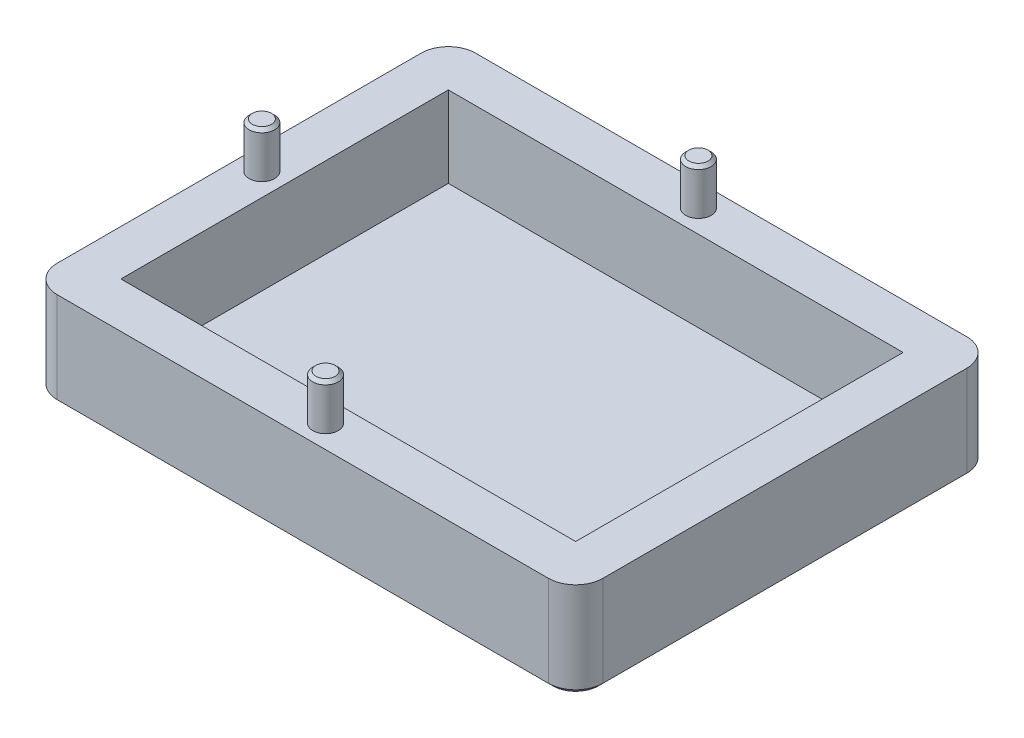
ISO-10303-21;
HEADER;
FILE_DESCRIPTION(('STEP AP214'),'2;1');
FILE_NAME('part.step','',(''),(''),'','','');
FILE_SCHEMA(('AUTOMOTIVE_DESIGN { 1 0 10303 214 1 1 1 1 }'));
ENDSEC;
DATA;
#1=APPLICATION_CONTEXT('core data for automotive mechanical design processes');
#2=APPLICATION_PROTOCOL_DEFINITION('international standard','automotive_design',2000,#1);
#3=PRODUCT_CONTEXT('',#1,'mechanical');
#4=PRODUCT('Part','Part','',(#3));
#5=PRODUCT_RELATED_PRODUCT_CATEGORY('part','',(#4));
#6=PRODUCT_DEFINITION_FORMATION('','',#4);
#7=PRODUCT_DEFINITION_CONTEXT('part definition',#1,'design');
#8=PRODUCT_DEFINITION('design','',#6,#7);
#9=PRODUCT_DEFINITION_SHAPE('','',#8);
#10=(LENGTH_UNIT() NAMED_UNIT(*) SI_UNIT(.MILLI.,.METRE.));
#11=(NAMED_UNIT(*) PLANE_ANGLE_UNIT() SI_UNIT($,.RADIAN.));
#12=(NAMED_UNIT(*) SI_UNIT($,.STERADIAN.) SOLID_ANGLE_UNIT());
#13=UNCERTAINTY_MEASURE_WITH_UNIT(LENGTH_MEASURE(1.E-05),#10,'distance_accuracy_value','');
#14=(GEOMETRIC_REPRESENTATION_CONTEXT(3) GLOBAL_UNCERTAINTY_ASSIGNED_CONTEXT((#13)) GLOBAL_UNIT_ASSIGNED_CONTEXT((#10,
#11,#12)) REPRESENTATION_CONTEXT('',''));
#15=CARTESIAN_POINT('',(0.,0.,0.));
#16=DIRECTION('',(0.,0.,1.));
#17=DIRECTION('',(1.,0.,0.));
#18=AXIS2_PLACEMENT_3D('',#15,#16,#17);
#19=CARTESIAN_POINT('',(0.,10.5,0.));
#20=DIRECTION('',(0.,-1.,0.));
#21=DIRECTION('',(0.,0.,-1.));
#22=AXIS2_PLACEMENT_3D('',#19,#20,#21);
#23=PLANE('',#22);
#24=CARTESIAN_POINT('',(25.,10.5,2.5));
#25=DIRECTION('',(0.,-1.,0.));
#26=DIRECTION('',(0.,0.,-1.));
#27=AXIS2_PLACEMENT_3D('',#24,#25,#26);
#28=CIRCLE('',#27,1.4);
#29=CARTESIAN_POINT('',(25.,10.5,1.1));
#30=VERTEX_POINT('',#29);
#31=EDGE_CURVE('E242',#30,#30,#28,.F.);
#32=ORIENTED_EDGE('',*,*,#31,.F.);
#33=EDGE_LOOP('',(#32));
#34=FACE_BOUND('',#33,.T.);
#35=CARTESIAN_POINT('',(-2.5,10.5,-18.));
#36=DIRECTION('',(0.,-1.,0.));
#37=DIRECTION('',(0.,0.,-1.));
#38=AXIS2_PLACEMENT_3D('',#35,#36,#37);
#39=CIRCLE('',#38,1.4);
#40=CARTESIAN_POINT('',(-2.5,10.5,-19.4));
#41=VERTEX_POINT('',#40);
#42=EDGE_CURVE('E239',#41,#41,#39,.F.);
#43=ORIENTED_EDGE('',*,*,#42,.F.);
#44=EDGE_LOOP('',(#43));
#45=FACE_BOUND('',#44,.T.);
#46=CARTESIAN_POINT('',(25.,10.5,-38.5));
#47=DIRECTION('',(0.,-1.,0.));
#48=DIRECTION('',(0.,0.,-1.));
#49=AXIS2_PLACEMENT_3D('',#46,#47,#48);
#50=CIRCLE('',#49,1.4);
#51=CARTESIAN_POINT('',(25.,10.5,-39.9));
#52=VERTEX_POINT('',#51);
#53=EDGE_CURVE('E236',#52,#52,#50,.F.);
#54=ORIENTED_EDGE('',*,*,#53,.F.);
#55=EDGE_LOOP('',(#54));
#56=FACE_BOUND('',#55,.T.);
#57=DIRECTION('',(0.,0.,-1.));
#58=VECTOR('',#57,1.);
#59=CARTESIAN_POINT('',(55.,10.5,5.));
#60=LINE('',#59,#58);
#61=CARTESIAN_POINT('',(55.,10.5,2.));
#62=VERTEX_POINT('',#61);
#63=CARTESIAN_POINT('',(55.,10.5,-38.));
#64=VERTEX_POINT('',#63);
#65=EDGE_CURVE('E204',#62,#64,#60,.T.);
#66=ORIENTED_EDGE('',*,*,#65,.T.);
#67=CARTESIAN_POINT('',(52.,10.5,-38.));
#68=DIRECTION('',(0.,-1.,0.));
#69=DIRECTION('',(0.,0.,-1.));
#70=AXIS2_PLACEMENT_3D('',#67,#68,#69);
#71=CIRCLE('',#70,3.);
#72=CARTESIAN_POINT('',(52.,10.5,-41.));
#73=VERTEX_POINT('',#72);
#74=EDGE_CURVE('E224',#64,#73,#71,.F.);
#75=ORIENTED_EDGE('',*,*,#74,.T.);
#76=DIRECTION('',(-1.,0.,0.));
#77=VECTOR('',#76,1.);
#78=CARTESIAN_POINT('',(-5.,10.5,-41.));
#79=LINE('',#78,#77);
#80=CARTESIAN_POINT('',(-2.,10.5,-41.));
#81=VERTEX_POINT('',#80);
#82=EDGE_CURVE('E207',#73,#81,#79,.T.);
#83=ORIENTED_EDGE('',*,*,#82,.T.);
#84=CARTESIAN_POINT('',(-2.,10.5,-38.));
#85=DIRECTION('',(0.,-1.,0.));
#86=DIRECTION('',(0.,0.,-1.));
#87=AXIS2_PLACEMENT_3D('',#84,#85,#86);
#88=CIRCLE('',#87,3.);
#89=CARTESIAN_POINT('',(-5.,10.5,-38.));
#90=VERTEX_POINT('',#89);
#91=EDGE_CURVE('E222',#81,#90,#88,.F.);
#92=ORIENTED_EDGE('',*,*,#91,.T.);
#93=DIRECTION('',(0.,0.,1.));
#94=VECTOR('',#93,1.);
#95=CARTESIAN_POINT('',(-5.,10.5,5.));
#96=LINE('',#95,#94);
#97=CARTESIAN_POINT('',(-5.,10.5,2.));
#98=VERTEX_POINT('',#97);
#99=EDGE_CURVE('E198',#90,#98,#96,.T.);
#100=ORIENTED_EDGE('',*,*,#99,.T.);
#101=CARTESIAN_POINT('',(-2.,10.5,2.));
#102=DIRECTION('',(0.,-1.,0.));
#103=DIRECTION('',(0.,0.,-1.));
#104=AXIS2_PLACEMENT_3D('',#101,#102,#103);
#105=CIRCLE('',#104,3.);
#106=CARTESIAN_POINT('',(-2.,10.5,5.));
#107=VERTEX_POINT('',#106);
#108=EDGE_CURVE('E218',#98,#107,#105,.F.);
#109=ORIENTED_EDGE('',*,*,#108,.T.);
#110=DIRECTION('',(1.,0.,0.));
#111=VECTOR('',#110,1.);
#112=CARTESIAN_POINT('',(-5.,10.5,5.));
#113=LINE('',#112,#111);
#114=CARTESIAN_POINT('',(52.,10.5,5.));
#115=VERTEX_POINT('',#114);
#116=EDGE_CURVE('E201',#107,#115,#113,.T.);
#117=ORIENTED_EDGE('',*,*,#116,.T.);
#118=CARTESIAN_POINT('',(52.,10.5,2.));
#119=DIRECTION('',(0.,-1.,0.));
#120=DIRECTION('',(0.,0.,-1.));
#121=AXIS2_PLACEMENT_3D('',#118,#119,#120);
#122=CIRCLE('',#121,3.);
#123=EDGE_CURVE('E220',#115,#62,#122,.F.);
#124=ORIENTED_EDGE('',*,*,#123,.T.);
#125=EDGE_LOOP('',(#66,#75,#83,#92,#100,#109,#117,#124));
#126=FACE_BOUND('',#125,.T.);
#127=DIRECTION('',(0.,0.,1.));
#128=VECTOR('',#127,1.);
#129=CARTESIAN_POINT('',(0.,10.5,0.));
#130=LINE('',#129,#128);
#131=CARTESIAN_POINT('',(0.,10.5,-36.));
#132=VERTEX_POINT('',#131);
#133=CARTESIAN_POINT('',(0.,10.5,0.));
#134=VERTEX_POINT('',#133);
#135=EDGE_CURVE('E181',#132,#134,#130,.T.);
#136=ORIENTED_EDGE('',*,*,#135,.F.);
#137=DIRECTION('',(-1.,0.,0.));
#138=VECTOR('',#137,1.);
#139=CARTESIAN_POINT('',(0.,10.5,-36.));
#140=LINE('',#139,#138);
#141=CARTESIAN_POINT('',(50.,10.5,-36.));
#142=VERTEX_POINT('',#141);
#143=EDGE_CURVE('E163',#142,#132,#140,.T.);
#144=ORIENTED_EDGE('',*,*,#143,.F.);
#145=DIRECTION('',(0.,0.,-1.));
#146=VECTOR('',#145,1.);
#147=CARTESIAN_POINT('',(50.,10.5,0.));
#148=LINE('',#147,#146);
#149=CARTESIAN_POINT('',(50.,10.5,0.));
#150=VERTEX_POINT('',#149);
#151=EDGE_CURVE('E189',#150,#142,#148,.T.);
#152=ORIENTED_EDGE('',*,*,#151,.F.);
#153=DIRECTION('',(1.,0.,0.));
#154=VECTOR('',#153,1.);
#155=CARTESIAN_POINT('',(0.,10.5,0.));
#156=LINE('',#155,#154);
#157=EDGE_CURVE('E183',#134,#150,#156,.T.);
#158=ORIENTED_EDGE('',*,*,#157,.F.);
#159=EDGE_LOOP('',(#136,#144,#152,#158));
#160=FACE_BOUND('',#159,.T.);
#161=ADVANCED_FACE('F41',(#34,#45,#56,#126,#160),#23,.F.);
#162=CARTESIAN_POINT('',(0.,0.,0.));
#163=DIRECTION('',(0.,-1.,0.));
#164=DIRECTION('',(0.,0.,-1.));
#165=AXIS2_PLACEMENT_3D('',#162,#163,#164);
#166=PLANE('',#165);
#167=DIRECTION('',(0.,0.,-1.));
#168=VECTOR('',#167,1.);
#169=CARTESIAN_POINT('',(-4.49999999999999,0.,-38.));
#170=LINE('',#169,#168);
#171=CARTESIAN_POINT('',(-4.49999999999999,0.,2.));
#172=VERTEX_POINT('',#171);
#173=CARTESIAN_POINT('',(-4.49999999999999,0.,-38.));
#174=VERTEX_POINT('',#173);
#175=EDGE_CURVE('E275',#172,#174,#170,.T.);
#176=ORIENTED_EDGE('',*,*,#175,.T.);
#177=CARTESIAN_POINT('',(-2.,0.,-38.));
#178=DIRECTION('',(0.,-1.,0.));
#179=DIRECTION('',(0.,0.,-1.));
#180=AXIS2_PLACEMENT_3D('',#177,#178,#179);
#181=CIRCLE('',#180,2.5);
#182=CARTESIAN_POINT('',(-2.,0.,-40.5));
#183=VERTEX_POINT('',#182);
#184=EDGE_CURVE('E277',#174,#183,#181,.T.);
#185=ORIENTED_EDGE('',*,*,#184,.T.);
#186=DIRECTION('',(1.,0.,0.));
#187=VECTOR('',#186,1.);
#188=CARTESIAN_POINT('',(52.,0.,-40.5));
#189=LINE('',#188,#187);
#190=CARTESIAN_POINT('',(52.,0.,-40.5));
#191=VERTEX_POINT('',#190);
#192=EDGE_CURVE('E263',#183,#191,#189,.T.);
#193=ORIENTED_EDGE('',*,*,#192,.T.);
#194=CARTESIAN_POINT('',(52.,0.,-38.));
#195=DIRECTION('',(0.,-1.,0.));
#196=DIRECTION('',(0.,0.,-1.));
#197=AXIS2_PLACEMENT_3D('',#194,#195,#196);
#198=CIRCLE('',#197,2.5);
#199=CARTESIAN_POINT('',(54.5,0.,-38.));
#200=VERTEX_POINT('',#199);
#201=EDGE_CURVE('E265',#191,#200,#198,.T.);
#202=ORIENTED_EDGE('',*,*,#201,.T.);
#203=DIRECTION('',(0.,0.,1.));
#204=VECTOR('',#203,1.);
#205=CARTESIAN_POINT('',(54.5,0.,2.));
#206=LINE('',#205,#204);
#207=CARTESIAN_POINT('',(54.5,0.,2.));
#208=VERTEX_POINT('',#207);
#209=EDGE_CURVE('E267',#200,#208,#206,.T.);
#210=ORIENTED_EDGE('',*,*,#209,.T.);
#211=CARTESIAN_POINT('',(52.,0.,2.));
#212=DIRECTION('',(0.,-1.,0.));
#213=DIRECTION('',(0.,0.,-1.));
#214=AXIS2_PLACEMENT_3D('',#211,#212,#213);
#215=CIRCLE('',#214,2.49999999999999);
#216=CARTESIAN_POINT('',(52.,0.,4.5));
#217=VERTEX_POINT('',#216);
#218=EDGE_CURVE('E269',#208,#217,#215,.T.);
#219=ORIENTED_EDGE('',*,*,#218,.T.);
#220=DIRECTION('',(-1.,0.,0.));
#221=VECTOR('',#220,1.);
#222=CARTESIAN_POINT('',(-2.,0.,4.49999999999999));
#223=LINE('',#222,#221);
#224=CARTESIAN_POINT('',(-2.,0.,4.49999999999999));
#225=VERTEX_POINT('',#224);
#226=EDGE_CURVE('E271',#217,#225,#223,.T.);
#227=ORIENTED_EDGE('',*,*,#226,.T.);
#228=CARTESIAN_POINT('',(-2.,0.,2.));
#229=DIRECTION('',(0.,-1.,0.));
#230=DIRECTION('',(0.,0.,-1.));
#231=AXIS2_PLACEMENT_3D('',#228,#229,#230);
#232=CIRCLE('',#231,2.49999999999999);
#233=EDGE_CURVE('E273',#225,#172,#232,.T.);
#234=ORIENTED_EDGE('',*,*,#233,.T.);
#235=EDGE_LOOP('',(#176,#185,#193,#202,#210,#219,#227,#234));
#236=FACE_BOUND('',#235,.T.);
#237=ADVANCED_FACE('F377',(#236),#166,.T.);
#238=CARTESIAN_POINT('',(-5.,10.5,5.));
#239=DIRECTION('',(1.,0.,0.));
#240=DIRECTION('',(0.,0.,-1.));
#241=AXIS2_PLACEMENT_3D('',#238,#239,#240);
#242=PLANE('',#241);
#243=DIRECTION('',(0.,-1.,0.));
#244=VECTOR('',#243,1.);
#245=CARTESIAN_POINT('',(-5.,10.5,-38.));
#246=LINE('',#245,#244);
#247=CARTESIAN_POINT('',(-5.,0.500000000000007,-38.));
#248=VERTEX_POINT('',#247);
#249=EDGE_CURVE('E228',#90,#248,#246,.T.);
#250=ORIENTED_EDGE('',*,*,#249,.T.);
#251=DIRECTION('',(0.,0.,1.));
#252=VECTOR('',#251,1.);
#253=CARTESIAN_POINT('',(-5.,0.500000000000007,2.));
#254=LINE('',#253,#252);
#255=CARTESIAN_POINT('',(-5.,0.500000000000007,2.));
#256=VERTEX_POINT('',#255);
#257=EDGE_CURVE('E283',#248,#256,#254,.T.);
#258=ORIENTED_EDGE('',*,*,#257,.T.);
#259=DIRECTION('',(0.,-1.,0.));
#260=VECTOR('',#259,1.);
#261=CARTESIAN_POINT('',(-5.,10.5,2.));
#262=LINE('',#261,#260);
#263=EDGE_CURVE('E226',#256,#98,#262,.F.);
#264=ORIENTED_EDGE('',*,*,#263,.T.);
#265=ORIENTED_EDGE('',*,*,#99,.F.);
#266=EDGE_LOOP('',(#250,#258,#264,#265));
#267=FACE_BOUND('',#266,.T.);
#268=ADVANCED_FACE('F360',(#267),#242,.F.);
#269=CARTESIAN_POINT('',(-5.,10.5,5.));
#270=DIRECTION('',(0.,0.,-1.));
#271=DIRECTION('',(-1.,0.,0.));
#272=AXIS2_PLACEMENT_3D('',#269,#270,#271);
#273=PLANE('',#272);
#274=DIRECTION('',(0.,-1.,0.));
#275=VECTOR('',#274,1.);
#276=CARTESIAN_POINT('',(-2.,10.5,5.));
#277=LINE('',#276,#275);
#278=CARTESIAN_POINT('',(-2.,0.500000000000007,5.));
#279=VERTEX_POINT('',#278);
#280=EDGE_CURVE('E231',#107,#279,#277,.T.);
#281=ORIENTED_EDGE('',*,*,#280,.T.);
#282=DIRECTION('',(1.,0.,0.));
#283=VECTOR('',#282,1.);
#284=CARTESIAN_POINT('',(52.,0.500000000000007,5.));
#285=LINE('',#284,#283);
#286=CARTESIAN_POINT('',(52.,0.500000000000007,5.));
#287=VERTEX_POINT('',#286);
#288=EDGE_CURVE('E287',#279,#287,#285,.T.);
#289=ORIENTED_EDGE('',*,*,#288,.T.);
#290=DIRECTION('',(0.,-1.,0.));
#291=VECTOR('',#290,1.);
#292=CARTESIAN_POINT('',(52.,10.5,5.));
#293=LINE('',#292,#291);
#294=EDGE_CURVE('E234',#287,#115,#293,.F.);
#295=ORIENTED_EDGE('',*,*,#294,.T.);
#296=ORIENTED_EDGE('',*,*,#116,.F.);
#297=EDGE_LOOP('',(#281,#289,#295,#296));
#298=FACE_BOUND('',#297,.T.);
#299=ADVANCED_FACE('F369',(#298),#273,.F.);
#300=CARTESIAN_POINT('',(55.,10.5,5.));
#301=DIRECTION('',(-1.,0.,0.));
#302=DIRECTION('',(0.,0.,1.));
#303=AXIS2_PLACEMENT_3D('',#300,#301,#302);
#304=PLANE('',#303);
#305=DIRECTION('',(0.,-1.,0.));
#306=VECTOR('',#305,1.);
#307=CARTESIAN_POINT('',(55.,10.5,2.));
#308=LINE('',#307,#306);
#309=CARTESIAN_POINT('',(55.,0.500000000000007,2.));
#310=VERTEX_POINT('',#309);
#311=EDGE_CURVE('E214',#62,#310,#308,.T.);
#312=ORIENTED_EDGE('',*,*,#311,.T.);
#313=DIRECTION('',(0.,0.,-1.));
#314=VECTOR('',#313,1.);
#315=CARTESIAN_POINT('',(55.,0.500000000000007,-38.));
#316=LINE('',#315,#314);
#317=CARTESIAN_POINT('',(55.,0.500000000000007,-38.));
#318=VERTEX_POINT('',#317);
#319=EDGE_CURVE('E66',#310,#318,#316,.T.);
#320=ORIENTED_EDGE('',*,*,#319,.T.);
#321=DIRECTION('',(0.,-1.,0.));
#322=VECTOR('',#321,1.);
#323=CARTESIAN_POINT('',(55.,10.5,-38.));
#324=LINE('',#323,#322);
#325=EDGE_CURVE('E216',#318,#64,#324,.F.);
#326=ORIENTED_EDGE('',*,*,#325,.T.);
#327=ORIENTED_EDGE('',*,*,#65,.F.);
#328=EDGE_LOOP('',(#312,#320,#326,#327));
#329=FACE_BOUND('',#328,.T.);
#330=ADVANCED_FACE('F329',(#329),#304,.F.);
#331=CARTESIAN_POINT('',(-5.,10.5,-41.));
#332=DIRECTION('',(0.,0.,1.));
#333=DIRECTION('',(1.,0.,0.));
#334=AXIS2_PLACEMENT_3D('',#331,#332,#333);
#335=PLANE('',#334);
#336=DIRECTION('',(0.,-1.,0.));
#337=VECTOR('',#336,1.);
#338=CARTESIAN_POINT('',(52.,10.5,-41.));
#339=LINE('',#338,#337);
#340=CARTESIAN_POINT('',(52.,0.500000000000007,-41.));
#341=VERTEX_POINT('',#340);
#342=EDGE_CURVE('E212',#73,#341,#339,.T.);
#343=ORIENTED_EDGE('',*,*,#342,.T.);
#344=DIRECTION('',(-1.,0.,0.));
#345=VECTOR('',#344,1.);
#346=CARTESIAN_POINT('',(-2.,0.500000000000007,-41.));
#347=LINE('',#346,#345);
#348=CARTESIAN_POINT('',(-2.,0.500000000000007,-41.));
#349=VERTEX_POINT('',#348);
#350=EDGE_CURVE('E11',#341,#349,#347,.T.);
#351=ORIENTED_EDGE('',*,*,#350,.T.);
#352=DIRECTION('',(0.,-1.,0.));
#353=VECTOR('',#352,1.);
#354=CARTESIAN_POINT('',(-2.,10.5,-41.));
#355=LINE('',#354,#353);
#356=EDGE_CURVE('E210',#349,#81,#355,.F.);
#357=ORIENTED_EDGE('',*,*,#356,.T.);
#358=ORIENTED_EDGE('',*,*,#82,.F.);
#359=EDGE_LOOP('',(#343,#351,#357,#358));
#360=FACE_BOUND('',#359,.T.);
#361=ADVANCED_FACE('F338',(#360),#335,.F.);
#362=CARTESIAN_POINT('',(0.,10.5,0.));
#363=DIRECTION('',(1.,0.,0.));
#364=DIRECTION('',(0.,0.,-1.));
#365=AXIS2_PLACEMENT_3D('',#362,#363,#364);
#366=PLANE('',#365);
#367=DIRECTION('',(0.,0.,1.));
#368=VECTOR('',#367,1.);
#369=CARTESIAN_POINT('',(0.,1.6,-36.));
#370=LINE('',#369,#368);
#371=CARTESIAN_POINT('',(0.,1.6,-36.));
#372=VERTEX_POINT('',#371);
#373=CARTESIAN_POINT('',(0.,1.6,0.));
#374=VERTEX_POINT('',#373);
#375=EDGE_CURVE('E170',#372,#374,#370,.T.);
#376=ORIENTED_EDGE('',*,*,#375,.F.);
#377=DIRECTION('',(0.,-1.,0.));
#378=VECTOR('',#377,1.);
#379=CARTESIAN_POINT('',(0.,10.5,-36.));
#380=LINE('',#379,#378);
#381=EDGE_CURVE('E156',#132,#372,#380,.T.);
#382=ORIENTED_EDGE('',*,*,#381,.F.);
#383=ORIENTED_EDGE('',*,*,#135,.T.);
#384=DIRECTION('',(0.,-1.,0.));
#385=VECTOR('',#384,1.);
#386=CARTESIAN_POINT('',(0.,10.5,0.));
#387=LINE('',#386,#385);
#388=EDGE_CURVE('E173',#134,#374,#387,.T.);
#389=ORIENTED_EDGE('',*,*,#388,.T.);
#390=EDGE_LOOP('',(#376,#382,#383,#389));
#391=FACE_BOUND('',#390,.T.);
#392=ADVANCED_FACE('F171',(#391),#366,.T.);
#393=CARTESIAN_POINT('',(0.,10.5,0.));
#394=DIRECTION('',(0.,0.,-1.));
#395=DIRECTION('',(-1.,0.,0.));
#396=AXIS2_PLACEMENT_3D('',#393,#394,#395);
#397=PLANE('',#396);
#398=DIRECTION('',(1.,0.,0.));
#399=VECTOR('',#398,1.);
#400=CARTESIAN_POINT('',(0.,1.6,0.));
#401=LINE('',#400,#399);
#402=CARTESIAN_POINT('',(50.,1.6,0.));
#403=VERTEX_POINT('',#402);
#404=EDGE_CURVE('E176',#374,#403,#401,.T.);
#405=ORIENTED_EDGE('',*,*,#404,.F.);
#406=ORIENTED_EDGE('',*,*,#388,.F.);
#407=ORIENTED_EDGE('',*,*,#157,.T.);
#408=DIRECTION('',(0.,-1.,0.));
#409=VECTOR('',#408,1.);
#410=CARTESIAN_POINT('',(50.,10.5,0.));
#411=LINE('',#410,#409);
#412=EDGE_CURVE('E194',#150,#403,#411,.T.);
#413=ORIENTED_EDGE('',*,*,#412,.T.);
#414=EDGE_LOOP('',(#405,#406,#407,#413));
#415=FACE_BOUND('',#414,.T.);
#416=ADVANCED_FACE('F399',(#415),#397,.T.);
#417=CARTESIAN_POINT('',(50.,10.5,0.));
#418=DIRECTION('',(-1.,0.,0.));
#419=DIRECTION('',(0.,0.,1.));
#420=AXIS2_PLACEMENT_3D('',#417,#418,#419);
#421=PLANE('',#420);
#422=DIRECTION('',(0.,0.,-1.));
#423=VECTOR('',#422,1.);
#424=CARTESIAN_POINT('',(50.,1.6,-36.));
#425=LINE('',#424,#423);
#426=CARTESIAN_POINT('',(50.,1.6,-36.));
#427=VERTEX_POINT('',#426);
#428=EDGE_CURVE('E180',#403,#427,#425,.T.);
#429=ORIENTED_EDGE('',*,*,#428,.F.);
#430=ORIENTED_EDGE('',*,*,#412,.F.);
#431=ORIENTED_EDGE('',*,*,#151,.T.);
#432=DIRECTION('',(0.,-1.,0.));
#433=VECTOR('',#432,1.);
#434=CARTESIAN_POINT('',(50.,10.5,-36.));
#435=LINE('',#434,#433);
#436=EDGE_CURVE('E166',#142,#427,#435,.T.);
#437=ORIENTED_EDGE('',*,*,#436,.T.);
#438=EDGE_LOOP('',(#429,#430,#431,#437));
#439=FACE_BOUND('',#438,.T.);
#440=ADVANCED_FACE('F403',(#439),#421,.T.);
#441=CARTESIAN_POINT('',(0.,10.5,-36.));
#442=DIRECTION('',(0.,0.,1.));
#443=DIRECTION('',(1.,0.,0.));
#444=AXIS2_PLACEMENT_3D('',#441,#442,#443);
#445=PLANE('',#444);
#446=DIRECTION('',(-1.,0.,0.));
#447=VECTOR('',#446,1.);
#448=CARTESIAN_POINT('',(0.,1.6,-36.));
#449=LINE('',#448,#447);
#450=EDGE_CURVE('E160',#427,#372,#449,.T.);
#451=ORIENTED_EDGE('',*,*,#450,.F.);
#452=ORIENTED_EDGE('',*,*,#436,.F.);
#453=ORIENTED_EDGE('',*,*,#143,.T.);
#454=ORIENTED_EDGE('',*,*,#381,.T.);
#455=EDGE_LOOP('',(#451,#452,#453,#454));
#456=FACE_BOUND('',#455,.T.);
#457=ADVANCED_FACE('F158',(#456),#445,.T.);
#458=CARTESIAN_POINT('',(0.,1.6,0.));
#459=DIRECTION('',(0.,1.,0.));
#460=DIRECTION('',(0.,0.,1.));
#461=AXIS2_PLACEMENT_3D('',#458,#459,#460);
#462=PLANE('',#461);
#463=ORIENTED_EDGE('',*,*,#375,.T.);
#464=ORIENTED_EDGE('',*,*,#404,.T.);
#465=ORIENTED_EDGE('',*,*,#428,.T.);
#466=ORIENTED_EDGE('',*,*,#450,.T.);
#467=EDGE_LOOP('',(#463,#464,#465,#466));
#468=FACE_BOUND('',#467,.T.);
#469=ADVANCED_FACE('F179',(#468),#462,.T.);
#470=CARTESIAN_POINT('',(52.,10.5,-38.));
#471=DIRECTION('',(0.,-1.,0.));
#472=DIRECTION('',(0.,0.,-1.));
#473=AXIS2_PLACEMENT_3D('',#470,#471,#472);
#474=CYLINDRICAL_SURFACE('',#473,3.);
#475=ORIENTED_EDGE('',*,*,#325,.F.);
#476=CARTESIAN_POINT('',(52.,0.500000000000007,-38.));
#477=DIRECTION('',(0.,-1.,0.));
#478=DIRECTION('',(0.,0.,-1.));
#479=AXIS2_PLACEMENT_3D('',#476,#477,#478);
#480=CIRCLE('',#479,3.);
#481=EDGE_CURVE('E51',#318,#341,#480,.F.);
#482=ORIENTED_EDGE('',*,*,#481,.T.);
#483=ORIENTED_EDGE('',*,*,#342,.F.);
#484=ORIENTED_EDGE('',*,*,#74,.F.);
#485=EDGE_LOOP('',(#475,#482,#483,#484));
#486=FACE_BOUND('',#485,.T.);
#487=ADVANCED_FACE('F334',(#486),#474,.T.);
#488=CARTESIAN_POINT('',(-2.,10.5,-38.));
#489=DIRECTION('',(0.,-1.,0.));
#490=DIRECTION('',(0.,0.,-1.));
#491=AXIS2_PLACEMENT_3D('',#488,#489,#490);
#492=CYLINDRICAL_SURFACE('',#491,3.);
#493=ORIENTED_EDGE('',*,*,#356,.F.);
#494=CARTESIAN_POINT('',(-2.,0.500000000000007,-38.));
#495=DIRECTION('',(0.,-1.,0.));
#496=DIRECTION('',(0.,0.,-1.));
#497=AXIS2_PLACEMENT_3D('',#494,#495,#496);
#498=CIRCLE('',#497,3.);
#499=EDGE_CURVE('E280',#349,#248,#498,.F.);
#500=ORIENTED_EDGE('',*,*,#499,.T.);
#501=ORIENTED_EDGE('',*,*,#249,.F.);
#502=ORIENTED_EDGE('',*,*,#91,.F.);
#503=EDGE_LOOP('',(#493,#500,#501,#502));
#504=FACE_BOUND('',#503,.T.);
#505=ADVANCED_FACE('F356',(#504),#492,.T.);
#506=CARTESIAN_POINT('',(52.,10.5,2.));
#507=DIRECTION('',(0.,-1.,0.));
#508=DIRECTION('',(0.,0.,-1.));
#509=AXIS2_PLACEMENT_3D('',#506,#507,#508);
#510=CYLINDRICAL_SURFACE('',#509,3.);
#511=ORIENTED_EDGE('',*,*,#294,.F.);
#512=CARTESIAN_POINT('',(52.,0.500000000000007,2.));
#513=DIRECTION('',(0.,-1.,0.));
#514=DIRECTION('',(0.,0.,-1.));
#515=AXIS2_PLACEMENT_3D('',#512,#513,#514);
#516=CIRCLE('',#515,3.);
#517=EDGE_CURVE('E289',#287,#310,#516,.F.);
#518=ORIENTED_EDGE('',*,*,#517,.T.);
#519=ORIENTED_EDGE('',*,*,#311,.F.);
#520=ORIENTED_EDGE('',*,*,#123,.F.);
#521=EDGE_LOOP('',(#511,#518,#519,#520));
#522=FACE_BOUND('',#521,.T.);
#523=ADVANCED_FACE('F326',(#522),#510,.T.);
#524=CARTESIAN_POINT('',(-2.,10.5,2.));
#525=DIRECTION('',(0.,-1.,0.));
#526=DIRECTION('',(0.,0.,-1.));
#527=AXIS2_PLACEMENT_3D('',#524,#525,#526);
#528=CYLINDRICAL_SURFACE('',#527,3.);
#529=ORIENTED_EDGE('',*,*,#263,.F.);
#530=CARTESIAN_POINT('',(-2.,0.500000000000007,2.));
#531=DIRECTION('',(0.,-1.,0.));
#532=DIRECTION('',(0.,0.,-1.));
#533=AXIS2_PLACEMENT_3D('',#530,#531,#532);
#534=CIRCLE('',#533,3.);
#535=EDGE_CURVE('E285',#256,#279,#534,.F.);
#536=ORIENTED_EDGE('',*,*,#535,.T.);
#537=ORIENTED_EDGE('',*,*,#280,.F.);
#538=ORIENTED_EDGE('',*,*,#108,.F.);
#539=EDGE_LOOP('',(#529,#536,#537,#538));
#540=FACE_BOUND('',#539,.T.);
#541=ADVANCED_FACE('F366',(#540),#528,.T.);
#542=CARTESIAN_POINT('',(25.,15.5,-38.5));
#543=DIRECTION('',(0.,-1.,0.));
#544=DIRECTION('',(0.,0.,-1.));
#545=AXIS2_PLACEMENT_3D('',#542,#543,#544);
#546=CYLINDRICAL_SURFACE('',#545,1.4);
#547=CARTESIAN_POINT('',(25.,15.15,-38.5));
#548=DIRECTION('',(0.,1.,0.));
#549=DIRECTION('',(0.,0.,1.));
#550=AXIS2_PLACEMENT_3D('',#547,#548,#549);
#551=CIRCLE('',#550,1.4);
#552=CARTESIAN_POINT('',(25.,15.15,-37.1));
#553=VERTEX_POINT('',#552);
#554=EDGE_CURVE('E260',#553,#553,#551,.F.);
#555=ORIENTED_EDGE('',*,*,#554,.T.);
#556=EDGE_LOOP('',(#555));
#557=FACE_BOUND('',#556,.T.);
#558=ORIENTED_EDGE('',*,*,#53,.T.);
#559=EDGE_LOOP('',(#558));
#560=FACE_BOUND('',#559,.T.);
#561=ADVANCED_FACE('F414',(#557,#560),#546,.T.);
#562=CARTESIAN_POINT('',(25.,15.5,-38.5));
#563=DIRECTION('',(0.,1.,0.));
#564=DIRECTION('',(0.,0.,1.));
#565=AXIS2_PLACEMENT_3D('',#562,#563,#564);
#566=PLANE('',#565);
#567=CARTESIAN_POINT('',(25.,15.5,-38.5));
#568=DIRECTION('',(0.,1.,0.));
#569=DIRECTION('',(0.,0.,1.));
#570=AXIS2_PLACEMENT_3D('',#567,#568,#569);
#571=CIRCLE('',#570,1.05);
#572=CARTESIAN_POINT('',(25.,15.5,-37.45));
#573=VERTEX_POINT('',#572);
#574=EDGE_CURVE('E257',#573,#573,#571,.T.);
#575=ORIENTED_EDGE('',*,*,#574,.T.);
#576=EDGE_LOOP('',(#575));
#577=FACE_BOUND('',#576,.T.);
#578=ADVANCED_FACE('F416',(#577),#566,.T.);
#579=CARTESIAN_POINT('',(-2.5,15.5,-18.));
#580=DIRECTION('',(0.,-1.,0.));
#581=DIRECTION('',(0.,0.,-1.));
#582=AXIS2_PLACEMENT_3D('',#579,#580,#581);
#583=CYLINDRICAL_SURFACE('',#582,1.4);
#584=CARTESIAN_POINT('',(-2.5,15.15,-18.));
#585=DIRECTION('',(0.,1.,0.));
#586=DIRECTION('',(0.,0.,1.));
#587=AXIS2_PLACEMENT_3D('',#584,#585,#586);
#588=CIRCLE('',#587,1.4);
#589=CARTESIAN_POINT('',(-2.5,15.15,-16.6));
#590=VERTEX_POINT('',#589);
#591=EDGE_CURVE('E254',#590,#590,#588,.F.);
#592=ORIENTED_EDGE('',*,*,#591,.T.);
#593=EDGE_LOOP('',(#592));
#594=FACE_BOUND('',#593,.T.);
#595=ORIENTED_EDGE('',*,*,#42,.T.);
#596=EDGE_LOOP('',(#595));
#597=FACE_BOUND('',#596,.T.);
#598=ADVANCED_FACE('F420',(#594,#597),#583,.T.);
#599=CARTESIAN_POINT('',(-2.5,15.5,-18.));
#600=DIRECTION('',(0.,1.,0.));
#601=DIRECTION('',(0.,0.,1.));
#602=AXIS2_PLACEMENT_3D('',#599,#600,#601);
#603=PLANE('',#602);
#604=CARTESIAN_POINT('',(-2.5,15.5,-18.));
#605=DIRECTION('',(0.,1.,0.));
#606=DIRECTION('',(0.,0.,1.));
#607=AXIS2_PLACEMENT_3D('',#604,#605,#606);
#608=CIRCLE('',#607,1.05000000000001);
#609=CARTESIAN_POINT('',(-2.5,15.5,-16.95));
#610=VERTEX_POINT('',#609);
#611=EDGE_CURVE('E251',#610,#610,#608,.T.);
#612=ORIENTED_EDGE('',*,*,#611,.T.);
#613=EDGE_LOOP('',(#612));
#614=FACE_BOUND('',#613,.T.);
#615=ADVANCED_FACE('F422',(#614),#603,.T.);
#616=CARTESIAN_POINT('',(25.,15.5,2.5));
#617=DIRECTION('',(0.,-1.,0.));
#618=DIRECTION('',(0.,0.,-1.));
#619=AXIS2_PLACEMENT_3D('',#616,#617,#618);
#620=CYLINDRICAL_SURFACE('',#619,1.4);
#621=CARTESIAN_POINT('',(25.,15.15,2.5));
#622=DIRECTION('',(0.,-1.,0.));
#623=DIRECTION('',(0.,0.,-1.));
#624=AXIS2_PLACEMENT_3D('',#621,#622,#623);
#625=CIRCLE('',#624,1.4);
#626=CARTESIAN_POINT('',(25.,15.15,1.1));
#627=VERTEX_POINT('',#626);
#628=EDGE_CURVE('E248',#627,#627,#625,.T.);
#629=ORIENTED_EDGE('',*,*,#628,.T.);
#630=EDGE_LOOP('',(#629));
#631=FACE_BOUND('',#630,.T.);
#632=ORIENTED_EDGE('',*,*,#31,.T.);
#633=EDGE_LOOP('',(#632));
#634=FACE_BOUND('',#633,.T.);
#635=ADVANCED_FACE('F425',(#631,#634),#620,.T.);
#636=CARTESIAN_POINT('',(25.,15.5,2.5));
#637=DIRECTION('',(0.,-1.,0.));
#638=DIRECTION('',(0.,0.,-1.));
#639=AXIS2_PLACEMENT_3D('',#636,#637,#638);
#640=PLANE('',#639);
#641=CARTESIAN_POINT('',(25.,15.5,2.5));
#642=DIRECTION('',(0.,-1.,0.));
#643=DIRECTION('',(0.,0.,-1.));
#644=AXIS2_PLACEMENT_3D('',#641,#642,#643);
#645=CIRCLE('',#644,1.05000000000001);
#646=CARTESIAN_POINT('',(25.,15.5,1.44999999999999));
#647=VERTEX_POINT('',#646);
#648=EDGE_CURVE('E245',#647,#647,#645,.F.);
#649=ORIENTED_EDGE('',*,*,#648,.T.);
#650=EDGE_LOOP('',(#649));
#651=FACE_BOUND('',#650,.T.);
#652=ADVANCED_FACE('F430',(#651),#640,.F.);
#653=CARTESIAN_POINT('',(25.,15.5,2.5));
#654=DIRECTION('',(0.,-1.,0.));
#655=DIRECTION('',(0.,0.,-1.));
#656=AXIS2_PLACEMENT_3D('',#653,#654,#655);
#657=CONICAL_SURFACE('',#656,1.05000000000001,0.785398163397449);
#658=ORIENTED_EDGE('',*,*,#628,.F.);
#659=EDGE_LOOP('',(#658));
#660=FACE_BOUND('',#659,.T.);
#661=ORIENTED_EDGE('',*,*,#648,.F.);
#662=EDGE_LOOP('',(#661));
#663=FACE_BOUND('',#662,.T.);
#664=ADVANCED_FACE('F433',(#660,#663),#657,.T.);
#665=CARTESIAN_POINT('',(-2.5,15.5,-18.));
#666=DIRECTION('',(0.,-1.,0.));
#667=DIRECTION('',(0.,0.,-1.));
#668=AXIS2_PLACEMENT_3D('',#665,#666,#667);
#669=CONICAL_SURFACE('',#668,1.05000000000001,0.785398163397454);
#670=ORIENTED_EDGE('',*,*,#591,.F.);
#671=EDGE_LOOP('',(#670));
#672=FACE_BOUND('',#671,.T.);
#673=ORIENTED_EDGE('',*,*,#611,.F.);
#674=EDGE_LOOP('',(#673));
#675=FACE_BOUND('',#674,.T.);
#676=ADVANCED_FACE('F444',(#672,#675),#669,.T.);
#677=CARTESIAN_POINT('',(25.,15.5,-38.5));
#678=DIRECTION('',(0.,-1.,0.));
#679=DIRECTION('',(0.,0.,-1.));
#680=AXIS2_PLACEMENT_3D('',#677,#678,#679);
#681=CONICAL_SURFACE('',#680,1.05,0.785398163397454);
#682=ORIENTED_EDGE('',*,*,#554,.F.);
#683=EDGE_LOOP('',(#682));
#684=FACE_BOUND('',#683,.T.);
#685=ORIENTED_EDGE('',*,*,#574,.F.);
#686=EDGE_LOOP('',(#685));
#687=FACE_BOUND('',#686,.T.);
#688=ADVANCED_FACE('F450',(#684,#687),#681,.T.);
#689=CARTESIAN_POINT('',(52.,0.,2.));
#690=DIRECTION('',(0.,1.,0.));
#691=DIRECTION('',(0.,0.,1.));
#692=AXIS2_PLACEMENT_3D('',#689,#690,#691);
#693=CONICAL_SURFACE('',#692,2.5,0.785398163397446);
#694=DIRECTION('',(-0.707106781186547,-0.707106781186548,0.));
#695=VECTOR('',#694,1.);
#696=CARTESIAN_POINT('',(55.,0.500000000000007,2.));
#697=LINE('',#696,#695);
#698=EDGE_CURVE('E308',#310,#208,#697,.T.);
#699=ORIENTED_EDGE('',*,*,#698,.F.);
#700=ORIENTED_EDGE('',*,*,#517,.F.);
#701=DIRECTION('',(0.,0.707106781186549,0.707106781186546));
#702=VECTOR('',#701,1.);
#703=CARTESIAN_POINT('',(52.,0.,4.5));
#704=LINE('',#703,#702);
#705=EDGE_CURVE('E46',#217,#287,#704,.T.);
#706=ORIENTED_EDGE('',*,*,#705,.F.);
#707=ORIENTED_EDGE('',*,*,#218,.F.);
#708=EDGE_LOOP('',(#699,#700,#706,#707));
#709=FACE_BOUND('',#708,.T.);
#710=ADVANCED_FACE('F44',(#709),#693,.T.);
#711=CARTESIAN_POINT('',(-5.,0.500000000000007,5.));
#712=DIRECTION('',(0.,-0.707106781186547,0.707106781186547));
#713=DIRECTION('',(-1.,0.,0.));
#714=AXIS2_PLACEMENT_3D('',#711,#712,#713);
#715=PLANE('',#714);
#716=ORIENTED_EDGE('',*,*,#705,.T.);
#717=ORIENTED_EDGE('',*,*,#288,.F.);
#718=DIRECTION('',(0.,0.707106781186547,0.707106781186547));
#719=VECTOR('',#718,1.);
#720=CARTESIAN_POINT('',(-2.,0.,4.49999999999999));
#721=LINE('',#720,#719);
#722=EDGE_CURVE('E306',#225,#279,#721,.T.);
#723=ORIENTED_EDGE('',*,*,#722,.F.);
#724=ORIENTED_EDGE('',*,*,#226,.F.);
#725=EDGE_LOOP('',(#716,#717,#723,#724));
#726=FACE_BOUND('',#725,.T.);
#727=ADVANCED_FACE('F318',(#726),#715,.T.);
#728=CARTESIAN_POINT('',(55.,0.500000000000007,5.));
#729=DIRECTION('',(0.707106781186547,-0.707106781186547,0.));
#730=DIRECTION('',(0.,0.,1.));
#731=AXIS2_PLACEMENT_3D('',#728,#729,#730);
#732=PLANE('',#731);
#733=ORIENTED_EDGE('',*,*,#698,.T.);
#734=ORIENTED_EDGE('',*,*,#209,.F.);
#735=DIRECTION('',(-0.707106781186547,-0.707106781186547,0.));
#736=VECTOR('',#735,1.);
#737=CARTESIAN_POINT('',(55.,0.500000000000007,-38.));
#738=LINE('',#737,#736);
#739=EDGE_CURVE('E303',#318,#200,#738,.T.);
#740=ORIENTED_EDGE('',*,*,#739,.F.);
#741=ORIENTED_EDGE('',*,*,#319,.F.);
#742=EDGE_LOOP('',(#733,#734,#740,#741));
#743=FACE_BOUND('',#742,.T.);
#744=ADVANCED_FACE('F497',(#743),#732,.T.);
#745=CARTESIAN_POINT('',(-2.,0.,2.));
#746=DIRECTION('',(0.,1.,0.));
#747=DIRECTION('',(0.,0.,1.));
#748=AXIS2_PLACEMENT_3D('',#745,#746,#747);
#749=CONICAL_SURFACE('',#748,2.49999999999999,0.785398163397449);
#750=ORIENTED_EDGE('',*,*,#722,.T.);
#751=ORIENTED_EDGE('',*,*,#535,.F.);
#752=DIRECTION('',(-0.707106781186547,0.707106781186547,0.));
#753=VECTOR('',#752,1.);
#754=CARTESIAN_POINT('',(-4.49999999999999,0.,2.));
#755=LINE('',#754,#753);
#756=EDGE_CURVE('E300',#172,#256,#755,.T.);
#757=ORIENTED_EDGE('',*,*,#756,.F.);
#758=ORIENTED_EDGE('',*,*,#233,.F.);
#759=EDGE_LOOP('',(#750,#751,#757,#758));
#760=FACE_BOUND('',#759,.T.);
#761=ADVANCED_FACE('F491',(#760),#749,.T.);
#762=CARTESIAN_POINT('',(52.,0.,-38.));
#763=DIRECTION('',(0.,1.,0.));
#764=DIRECTION('',(0.,0.,1.));
#765=AXIS2_PLACEMENT_3D('',#762,#763,#764);
#766=CONICAL_SURFACE('',#765,2.5,0.785398163397446);
#767=ORIENTED_EDGE('',*,*,#739,.T.);
#768=ORIENTED_EDGE('',*,*,#201,.F.);
#769=DIRECTION('',(0.,-0.707106781186548,0.707106781186547));
#770=VECTOR('',#769,1.);
#771=CARTESIAN_POINT('',(52.,0.500000000000007,-41.));
#772=LINE('',#771,#770);
#773=EDGE_CURVE('E297',#341,#191,#772,.T.);
#774=ORIENTED_EDGE('',*,*,#773,.F.);
#775=ORIENTED_EDGE('',*,*,#481,.F.);
#776=EDGE_LOOP('',(#767,#768,#774,#775));
#777=FACE_BOUND('',#776,.T.);
#778=ADVANCED_FACE('F343',(#777),#766,.T.);
#779=CARTESIAN_POINT('',(-5.,0.500000000000007,5.));
#780=DIRECTION('',(-0.707106781186547,-0.707106781186547,0.));
#781=DIRECTION('',(0.,0.,-1.));
#782=AXIS2_PLACEMENT_3D('',#779,#780,#781);
#783=PLANE('',#782);
#784=ORIENTED_EDGE('',*,*,#756,.T.);
#785=ORIENTED_EDGE('',*,*,#257,.F.);
#786=DIRECTION('',(-0.707106781186547,0.707106781186547,0.));
#787=VECTOR('',#786,1.);
#788=CARTESIAN_POINT('',(-4.49999999999999,0.,-38.));
#789=LINE('',#788,#787);
#790=EDGE_CURVE('E295',#174,#248,#789,.T.);
#791=ORIENTED_EDGE('',*,*,#790,.F.);
#792=ORIENTED_EDGE('',*,*,#175,.F.);
#793=EDGE_LOOP('',(#784,#785,#791,#792));
#794=FACE_BOUND('',#793,.T.);
#795=ADVANCED_FACE('F479',(#794),#783,.T.);
#796=CARTESIAN_POINT('',(-5.,0.500000000000007,-41.));
#797=DIRECTION('',(0.,-0.707106781186547,-0.707106781186547));
#798=DIRECTION('',(1.,0.,0.));
#799=AXIS2_PLACEMENT_3D('',#796,#797,#798);
#800=PLANE('',#799);
#801=ORIENTED_EDGE('',*,*,#773,.T.);
#802=ORIENTED_EDGE('',*,*,#192,.F.);
#803=DIRECTION('',(0.,-0.707106781186547,0.707106781186547));
#804=VECTOR('',#803,1.);
#805=CARTESIAN_POINT('',(-2.,0.500000000000007,-41.));
#806=LINE('',#805,#804);
#807=EDGE_CURVE('E293',#349,#183,#806,.T.);
#808=ORIENTED_EDGE('',*,*,#807,.F.);
#809=ORIENTED_EDGE('',*,*,#350,.F.);
#810=EDGE_LOOP('',(#801,#802,#808,#809));
#811=FACE_BOUND('',#810,.T.);
#812=ADVANCED_FACE('F347',(#811),#800,.T.);
#813=CARTESIAN_POINT('',(-2.,0.,-38.));
#814=DIRECTION('',(0.,1.,0.));
#815=DIRECTION('',(0.,0.,1.));
#816=AXIS2_PLACEMENT_3D('',#813,#814,#815);
#817=CONICAL_SURFACE('',#816,2.49999999999999,0.785398163397449);
#818=ORIENTED_EDGE('',*,*,#790,.T.);
#819=ORIENTED_EDGE('',*,*,#499,.F.);
#820=ORIENTED_EDGE('',*,*,#807,.T.);
#821=ORIENTED_EDGE('',*,*,#184,.F.);
#822=EDGE_LOOP('',(#818,#819,#820,#821));
#823=FACE_BOUND('',#822,.T.);
#824=ADVANCED_FACE('F351',(#823),#817,.T.);
#825=CLOSED_SHELL('',(#161,#237,#268,#299,#330,#361,#392,#416,#440,#457,#469,#487,#505,#523,
#541,#561,#578,#598,#615,#635,#652,#664,#676,#688,#710,#727,#744,#761,#778,#795,#812,#824));
#826=MANIFOLD_SOLID_BREP('B2',#825);
#827=ADVANCED_BREP_SHAPE_REPRESENTATION('',(#18,#826),#14);
#828=SHAPE_DEFINITION_REPRESENTATION(#9,#827);
ENDSEC;
END-ISO-10303-21;
